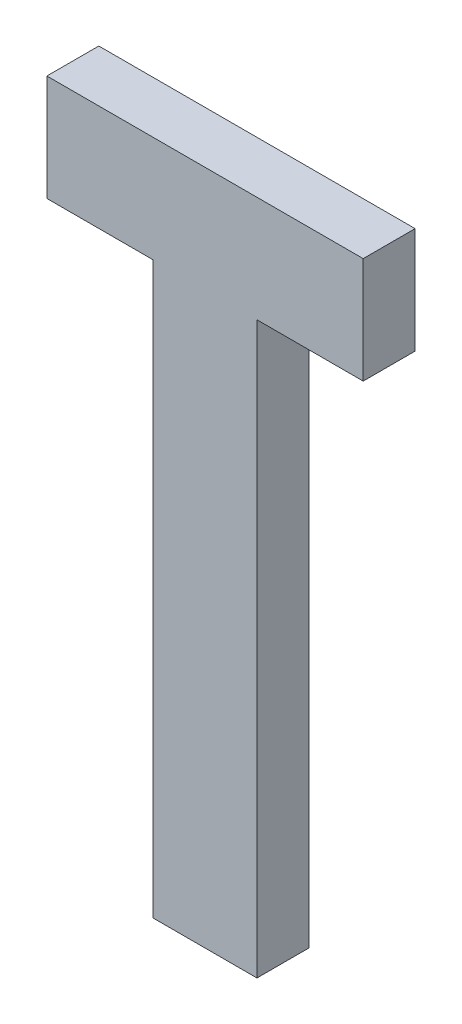
ISO-10303-21;
HEADER;
FILE_DESCRIPTION(('STEP AP214'),'2;1');
FILE_NAME('part.step','',(''),(''),'','','');
FILE_SCHEMA(('AUTOMOTIVE_DESIGN { 1 0 10303 214 1 1 1 1 }'));
ENDSEC;
DATA;
#1=APPLICATION_CONTEXT('core data for automotive mechanical design processes');
#2=APPLICATION_PROTOCOL_DEFINITION('international standard','automotive_design',2000,#1);
#3=PRODUCT_CONTEXT('',#1,'mechanical');
#4=PRODUCT('Part','Part','',(#3));
#5=PRODUCT_RELATED_PRODUCT_CATEGORY('part','',(#4));
#6=PRODUCT_DEFINITION_FORMATION('','',#4);
#7=PRODUCT_DEFINITION_CONTEXT('part definition',#1,'design');
#8=PRODUCT_DEFINITION('design','',#6,#7);
#9=PRODUCT_DEFINITION_SHAPE('','',#8);
#10=(LENGTH_UNIT() NAMED_UNIT(*) SI_UNIT(.MILLI.,.METRE.));
#11=(NAMED_UNIT(*) PLANE_ANGLE_UNIT() SI_UNIT($,.RADIAN.));
#12=(NAMED_UNIT(*) SI_UNIT($,.STERADIAN.) SOLID_ANGLE_UNIT());
#13=UNCERTAINTY_MEASURE_WITH_UNIT(LENGTH_MEASURE(1.E-05),#10,'distance_accuracy_value','');
#14=(GEOMETRIC_REPRESENTATION_CONTEXT(3) GLOBAL_UNCERTAINTY_ASSIGNED_CONTEXT((#13)) GLOBAL_UNIT_ASSIGNED_CONTEXT((#10,
#11,#12)) REPRESENTATION_CONTEXT('',''));
#15=CARTESIAN_POINT('',(0.,0.,0.));
#16=DIRECTION('',(0.,0.,1.));
#17=DIRECTION('',(1.,0.,0.));
#18=AXIS2_PLACEMENT_3D('',#15,#16,#17);
#19=CARTESIAN_POINT('',(-5.,-30.,5.));
#20=DIRECTION('',(1.,0.,0.));
#21=DIRECTION('',(0.,1.,0.));
#22=AXIS2_PLACEMENT_3D('',#19,#20,#21);
#23=PLANE('',#22);
#24=DIRECTION('',(0.,-1.,0.));
#25=VECTOR('',#24,1.);
#26=CARTESIAN_POINT('',(-5.,-30.,0.));
#27=LINE('',#26,#25);
#28=CARTESIAN_POINT('',(-5.,24.8914070592454,0.));
#29=VERTEX_POINT('',#28);
#30=CARTESIAN_POINT('',(-5.,-30.,0.));
#31=VERTEX_POINT('',#30);
#32=EDGE_CURVE('E127',#29,#31,#27,.T.);
#33=ORIENTED_EDGE('',*,*,#32,.T.);
#34=DIRECTION('',(0.,0.,-1.));
#35=VECTOR('',#34,1.);
#36=CARTESIAN_POINT('',(-5.,-30.,5.));
#37=LINE('',#36,#35);
#38=CARTESIAN_POINT('',(-5.,-30.,5.));
#39=VERTEX_POINT('',#38);
#40=EDGE_CURVE('E11',#39,#31,#37,.T.);
#41=ORIENTED_EDGE('',*,*,#40,.F.);
#42=DIRECTION('',(0.,-1.,0.));
#43=VECTOR('',#42,1.);
#44=CARTESIAN_POINT('',(-5.,-30.,5.));
#45=LINE('',#44,#43);
#46=CARTESIAN_POINT('',(-5.,24.8914070592454,5.));
#47=VERTEX_POINT('',#46);
#48=EDGE_CURVE('E141',#47,#39,#45,.T.);
#49=ORIENTED_EDGE('',*,*,#48,.F.);
#50=DIRECTION('',(0.,0.,-1.));
#51=VECTOR('',#50,1.);
#52=CARTESIAN_POINT('',(-5.,24.8914070592454,5.));
#53=LINE('',#52,#51);
#54=EDGE_CURVE('E123',#47,#29,#53,.T.);
#55=ORIENTED_EDGE('',*,*,#54,.T.);
#56=EDGE_LOOP('',(#33,#41,#49,#55));
#57=FACE_BOUND('',#56,.T.);
#58=ADVANCED_FACE('F31',(#57),#23,.F.);
#59=CARTESIAN_POINT('',(-5.,-30.,5.));
#60=DIRECTION('',(0.,1.,0.));
#61=DIRECTION('',(0.,0.,1.));
#62=AXIS2_PLACEMENT_3D('',#59,#60,#61);
#63=PLANE('',#62);
#64=DIRECTION('',(1.,0.,0.));
#65=VECTOR('',#64,1.);
#66=CARTESIAN_POINT('',(-5.,-30.,0.));
#67=LINE('',#66,#65);
#68=CARTESIAN_POINT('',(5.,-30.,0.));
#69=VERTEX_POINT('',#68);
#70=EDGE_CURVE('E130',#31,#69,#67,.T.);
#71=ORIENTED_EDGE('',*,*,#70,.T.);
#72=DIRECTION('',(0.,0.,-1.));
#73=VECTOR('',#72,1.);
#74=CARTESIAN_POINT('',(5.,-30.,5.));
#75=LINE('',#74,#73);
#76=CARTESIAN_POINT('',(5.,-30.,5.));
#77=VERTEX_POINT('',#76);
#78=EDGE_CURVE('E39',#77,#69,#75,.T.);
#79=ORIENTED_EDGE('',*,*,#78,.F.);
#80=DIRECTION('',(1.,0.,0.));
#81=VECTOR('',#80,1.);
#82=CARTESIAN_POINT('',(-5.,-30.,5.));
#83=LINE('',#82,#81);
#84=EDGE_CURVE('E90',#39,#77,#83,.T.);
#85=ORIENTED_EDGE('',*,*,#84,.F.);
#86=ORIENTED_EDGE('',*,*,#40,.T.);
#87=EDGE_LOOP('',(#71,#79,#85,#86));
#88=FACE_BOUND('',#87,.T.);
#89=ADVANCED_FACE('F176',(#88),#63,.F.);
#90=CARTESIAN_POINT('',(5.,-30.,5.));
#91=DIRECTION('',(-1.,0.,0.));
#92=DIRECTION('',(0.,0.,1.));
#93=AXIS2_PLACEMENT_3D('',#90,#91,#92);
#94=PLANE('',#93);
#95=DIRECTION('',(0.,1.,0.));
#96=VECTOR('',#95,1.);
#97=CARTESIAN_POINT('',(5.,-30.,0.));
#98=LINE('',#97,#96);
#99=CARTESIAN_POINT('',(5.,24.8914070592454,0.));
#100=VERTEX_POINT('',#99);
#101=EDGE_CURVE('E132',#69,#100,#98,.T.);
#102=ORIENTED_EDGE('',*,*,#101,.T.);
#103=DIRECTION('',(0.,0.,-1.));
#104=VECTOR('',#103,1.);
#105=CARTESIAN_POINT('',(5.,24.8914070592454,5.));
#106=LINE('',#105,#104);
#107=CARTESIAN_POINT('',(5.,24.8914070592454,5.));
#108=VERTEX_POINT('',#107);
#109=EDGE_CURVE('E148',#108,#100,#106,.T.);
#110=ORIENTED_EDGE('',*,*,#109,.F.);
#111=DIRECTION('',(0.,1.,0.));
#112=VECTOR('',#111,1.);
#113=CARTESIAN_POINT('',(5.,-30.,5.));
#114=LINE('',#113,#112);
#115=EDGE_CURVE('E156',#77,#108,#114,.T.);
#116=ORIENTED_EDGE('',*,*,#115,.F.);
#117=ORIENTED_EDGE('',*,*,#78,.T.);
#118=EDGE_LOOP('',(#102,#110,#116,#117));
#119=FACE_BOUND('',#118,.T.);
#120=ADVANCED_FACE('F154',(#119),#94,.F.);
#121=CARTESIAN_POINT('',(5.,24.8914070592454,5.));
#122=DIRECTION('',(0.,1.,0.));
#123=DIRECTION('',(0.,0.,1.));
#124=AXIS2_PLACEMENT_3D('',#121,#122,#123);
#125=PLANE('',#124);
#126=DIRECTION('',(1.,0.,0.));
#127=VECTOR('',#126,1.);
#128=CARTESIAN_POINT('',(5.,24.8914070592454,0.));
#129=LINE('',#128,#127);
#130=CARTESIAN_POINT('',(15.2295031708507,24.8914070592454,0.));
#131=VERTEX_POINT('',#130);
#132=EDGE_CURVE('E134',#100,#131,#129,.T.);
#133=ORIENTED_EDGE('',*,*,#132,.T.);
#134=DIRECTION('',(0.,0.,-1.));
#135=VECTOR('',#134,1.);
#136=CARTESIAN_POINT('',(15.2295031708507,24.8914070592454,5.));
#137=LINE('',#136,#135);
#138=CARTESIAN_POINT('',(15.2295031708507,24.8914070592454,5.));
#139=VERTEX_POINT('',#138);
#140=EDGE_CURVE('E145',#139,#131,#137,.T.);
#141=ORIENTED_EDGE('',*,*,#140,.F.);
#142=DIRECTION('',(1.,0.,0.));
#143=VECTOR('',#142,1.);
#144=CARTESIAN_POINT('',(5.,24.8914070592454,5.));
#145=LINE('',#144,#143);
#146=EDGE_CURVE('E168',#108,#139,#145,.T.);
#147=ORIENTED_EDGE('',*,*,#146,.F.);
#148=ORIENTED_EDGE('',*,*,#109,.T.);
#149=EDGE_LOOP('',(#133,#141,#147,#148));
#150=FACE_BOUND('',#149,.T.);
#151=ADVANCED_FACE('F164',(#150),#125,.F.);
#152=CARTESIAN_POINT('',(15.2295031708507,24.8914070592454,5.));
#153=DIRECTION('',(-1.,0.,0.));
#154=DIRECTION('',(0.,0.,1.));
#155=AXIS2_PLACEMENT_3D('',#152,#153,#154);
#156=PLANE('',#155);
#157=DIRECTION('',(0.,1.,0.));
#158=VECTOR('',#157,1.);
#159=CARTESIAN_POINT('',(15.2295031708507,24.8914070592454,0.));
#160=LINE('',#159,#158);
#161=CARTESIAN_POINT('',(15.2295031708507,35.1085929407546,0.));
#162=VERTEX_POINT('',#161);
#163=EDGE_CURVE('E136',#131,#162,#160,.T.);
#164=ORIENTED_EDGE('',*,*,#163,.T.);
#165=DIRECTION('',(0.,0.,-1.));
#166=VECTOR('',#165,1.);
#167=CARTESIAN_POINT('',(15.2295031708507,35.1085929407546,5.));
#168=LINE('',#167,#166);
#169=CARTESIAN_POINT('',(15.2295031708507,35.1085929407546,5.));
#170=VERTEX_POINT('',#169);
#171=EDGE_CURVE('E118',#170,#162,#168,.T.);
#172=ORIENTED_EDGE('',*,*,#171,.F.);
#173=DIRECTION('',(0.,1.,0.));
#174=VECTOR('',#173,1.);
#175=CARTESIAN_POINT('',(15.2295031708507,24.8914070592454,5.));
#176=LINE('',#175,#174);
#177=EDGE_CURVE('E109',#139,#170,#176,.T.);
#178=ORIENTED_EDGE('',*,*,#177,.F.);
#179=ORIENTED_EDGE('',*,*,#140,.T.);
#180=EDGE_LOOP('',(#164,#172,#178,#179));
#181=FACE_BOUND('',#180,.T.);
#182=ADVANCED_FACE('F167',(#181),#156,.F.);
#183=CARTESIAN_POINT('',(-15.2295031708507,35.1085929407546,5.));
#184=DIRECTION('',(0.,-1.,0.));
#185=DIRECTION('',(0.,0.,-1.));
#186=AXIS2_PLACEMENT_3D('',#183,#184,#185);
#187=PLANE('',#186);
#188=DIRECTION('',(-1.,0.,0.));
#189=VECTOR('',#188,1.);
#190=CARTESIAN_POINT('',(-15.2295031708507,35.1085929407546,0.));
#191=LINE('',#190,#189);
#192=CARTESIAN_POINT('',(-15.2295031708507,35.1085929407546,0.));
#193=VERTEX_POINT('',#192);
#194=EDGE_CURVE('E117',#162,#193,#191,.T.);
#195=ORIENTED_EDGE('',*,*,#194,.T.);
#196=DIRECTION('',(0.,0.,-1.));
#197=VECTOR('',#196,1.);
#198=CARTESIAN_POINT('',(-15.2295031708507,35.1085929407546,5.));
#199=LINE('',#198,#197);
#200=CARTESIAN_POINT('',(-15.2295031708507,35.1085929407546,5.));
#201=VERTEX_POINT('',#200);
#202=EDGE_CURVE('E114',#201,#193,#199,.T.);
#203=ORIENTED_EDGE('',*,*,#202,.F.);
#204=DIRECTION('',(-1.,0.,0.));
#205=VECTOR('',#204,1.);
#206=CARTESIAN_POINT('',(-15.2295031708507,35.1085929407546,5.));
#207=LINE('',#206,#205);
#208=EDGE_CURVE('E103',#170,#201,#207,.T.);
#209=ORIENTED_EDGE('',*,*,#208,.F.);
#210=ORIENTED_EDGE('',*,*,#171,.T.);
#211=EDGE_LOOP('',(#195,#203,#209,#210));
#212=FACE_BOUND('',#211,.T.);
#213=ADVANCED_FACE('F115',(#212),#187,.F.);
#214=CARTESIAN_POINT('',(-15.2295031708507,24.8914070592454,5.));
#215=DIRECTION('',(1.,0.,0.));
#216=DIRECTION('',(0.,0.,-1.));
#217=AXIS2_PLACEMENT_3D('',#214,#215,#216);
#218=PLANE('',#217);
#219=DIRECTION('',(0.,-1.,0.));
#220=VECTOR('',#219,1.);
#221=CARTESIAN_POINT('',(-15.2295031708507,24.8914070592454,0.));
#222=LINE('',#221,#220);
#223=CARTESIAN_POINT('',(-15.2295031708507,24.8914070592454,0.));
#224=VERTEX_POINT('',#223);
#225=EDGE_CURVE('E76',#193,#224,#222,.T.);
#226=ORIENTED_EDGE('',*,*,#225,.T.);
#227=DIRECTION('',(0.,0.,-1.));
#228=VECTOR('',#227,1.);
#229=CARTESIAN_POINT('',(-15.2295031708507,24.8914070592454,5.));
#230=LINE('',#229,#228);
#231=CARTESIAN_POINT('',(-15.2295031708507,24.8914070592454,5.));
#232=VERTEX_POINT('',#231);
#233=EDGE_CURVE('E119',#232,#224,#230,.T.);
#234=ORIENTED_EDGE('',*,*,#233,.F.);
#235=DIRECTION('',(0.,-1.,0.));
#236=VECTOR('',#235,1.);
#237=CARTESIAN_POINT('',(-15.2295031708507,24.8914070592454,5.));
#238=LINE('',#237,#236);
#239=EDGE_CURVE('E107',#201,#232,#238,.T.);
#240=ORIENTED_EDGE('',*,*,#239,.F.);
#241=ORIENTED_EDGE('',*,*,#202,.T.);
#242=EDGE_LOOP('',(#226,#234,#240,#241));
#243=FACE_BOUND('',#242,.T.);
#244=ADVANCED_FACE('F121',(#243),#218,.F.);
#245=CARTESIAN_POINT('',(-15.2295031708507,24.8914070592454,5.));
#246=DIRECTION('',(0.,1.,0.));
#247=DIRECTION('',(0.,0.,1.));
#248=AXIS2_PLACEMENT_3D('',#245,#246,#247);
#249=PLANE('',#248);
#250=DIRECTION('',(1.,0.,0.));
#251=VECTOR('',#250,1.);
#252=CARTESIAN_POINT('',(-15.2295031708507,24.8914070592454,0.));
#253=LINE('',#252,#251);
#254=EDGE_CURVE('E82',#224,#29,#253,.T.);
#255=ORIENTED_EDGE('',*,*,#254,.T.);
#256=ORIENTED_EDGE('',*,*,#54,.F.);
#257=DIRECTION('',(1.,0.,0.));
#258=VECTOR('',#257,1.);
#259=CARTESIAN_POINT('',(-15.2295031708507,24.8914070592454,5.));
#260=LINE('',#259,#258);
#261=EDGE_CURVE('E47',#232,#47,#260,.T.);
#262=ORIENTED_EDGE('',*,*,#261,.F.);
#263=ORIENTED_EDGE('',*,*,#233,.T.);
#264=EDGE_LOOP('',(#255,#256,#262,#263));
#265=FACE_BOUND('',#264,.T.);
#266=ADVANCED_FACE('F192',(#265),#249,.F.);
#267=CARTESIAN_POINT('',(-5.,24.8914070592454,5.));
#268=DIRECTION('',(0.,0.,-1.));
#269=DIRECTION('',(-1.,0.,0.));
#270=AXIS2_PLACEMENT_3D('',#267,#268,#269);
#271=PLANE('',#270);
#272=ORIENTED_EDGE('',*,*,#48,.T.);
#273=ORIENTED_EDGE('',*,*,#84,.T.);
#274=ORIENTED_EDGE('',*,*,#115,.T.);
#275=ORIENTED_EDGE('',*,*,#146,.T.);
#276=ORIENTED_EDGE('',*,*,#177,.T.);
#277=ORIENTED_EDGE('',*,*,#208,.T.);
#278=ORIENTED_EDGE('',*,*,#239,.T.);
#279=ORIENTED_EDGE('',*,*,#261,.T.);
#280=EDGE_LOOP('',(#272,#273,#274,#275,#276,#277,#278,#279));
#281=FACE_BOUND('',#280,.T.);
#282=ADVANCED_FACE('F105',(#281),#271,.F.);
#283=CARTESIAN_POINT('',(-5.,24.8914070592454,0.));
#284=DIRECTION('',(0.,0.,-1.));
#285=DIRECTION('',(-1.,0.,0.));
#286=AXIS2_PLACEMENT_3D('',#283,#284,#285);
#287=PLANE('',#286);
#288=ORIENTED_EDGE('',*,*,#32,.F.);
#289=ORIENTED_EDGE('',*,*,#254,.F.);
#290=ORIENTED_EDGE('',*,*,#225,.F.);
#291=ORIENTED_EDGE('',*,*,#194,.F.);
#292=ORIENTED_EDGE('',*,*,#163,.F.);
#293=ORIENTED_EDGE('',*,*,#132,.F.);
#294=ORIENTED_EDGE('',*,*,#101,.F.);
#295=ORIENTED_EDGE('',*,*,#70,.F.);
#296=EDGE_LOOP('',(#288,#289,#290,#291,#292,#293,#294,#295));
#297=FACE_BOUND('',#296,.T.);
#298=ADVANCED_FACE('F160',(#297),#287,.T.);
#299=CLOSED_SHELL('',(#58,#89,#120,#151,#182,#213,#244,#266,#282,#298));
#300=MANIFOLD_SOLID_BREP('B2',#299);
#301=ADVANCED_BREP_SHAPE_REPRESENTATION('',(#18,#300),#14);
#302=SHAPE_DEFINITION_REPRESENTATION(#9,#301);
ENDSEC;
END-ISO-10303-21;
